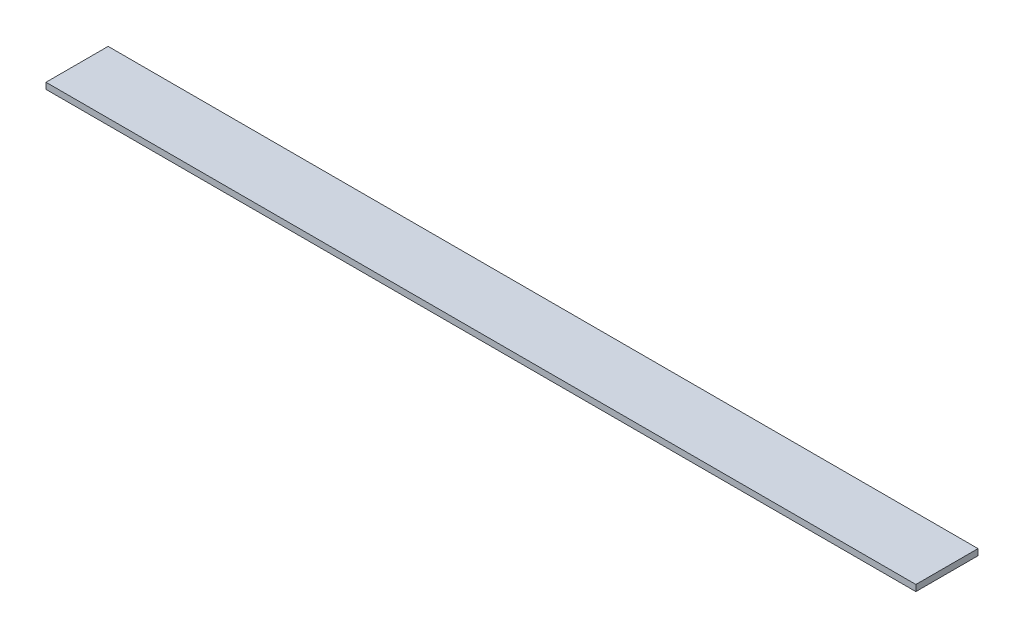
ISO-10303-21;
HEADER;
FILE_DESCRIPTION(('STEP AP214'),'2;1');
FILE_NAME('part.step','',(''),(''),'','','');
FILE_SCHEMA(('AUTOMOTIVE_DESIGN { 1 0 10303 214 1 1 1 1 }'));
ENDSEC;
DATA;
#1=APPLICATION_CONTEXT('core data for automotive mechanical design processes');
#2=APPLICATION_PROTOCOL_DEFINITION('international standard','automotive_design',2000,#1);
#3=PRODUCT_CONTEXT('',#1,'mechanical');
#4=PRODUCT('Part','Part','',(#3));
#5=PRODUCT_RELATED_PRODUCT_CATEGORY('part','',(#4));
#6=PRODUCT_DEFINITION_FORMATION('','',#4);
#7=PRODUCT_DEFINITION_CONTEXT('part definition',#1,'design');
#8=PRODUCT_DEFINITION('design','',#6,#7);
#9=PRODUCT_DEFINITION_SHAPE('','',#8);
#10=(LENGTH_UNIT() NAMED_UNIT(*) SI_UNIT(.MILLI.,.METRE.));
#11=(NAMED_UNIT(*) PLANE_ANGLE_UNIT() SI_UNIT($,.RADIAN.));
#12=(NAMED_UNIT(*) SI_UNIT($,.STERADIAN.) SOLID_ANGLE_UNIT());
#13=UNCERTAINTY_MEASURE_WITH_UNIT(LENGTH_MEASURE(1.E-05),#10,'distance_accuracy_value','');
#14=(GEOMETRIC_REPRESENTATION_CONTEXT(3) GLOBAL_UNCERTAINTY_ASSIGNED_CONTEXT((#13)) GLOBAL_UNIT_ASSIGNED_CONTEXT((#10,
#11,#12)) REPRESENTATION_CONTEXT('',''));
#15=CARTESIAN_POINT('',(0.,0.,0.));
#16=DIRECTION('',(0.,0.,1.));
#17=DIRECTION('',(1.,0.,0.));
#18=AXIS2_PLACEMENT_3D('',#15,#16,#17);
#19=CARTESIAN_POINT('',(0.,10.,0.));
#20=DIRECTION('',(1.,0.,0.));
#21=DIRECTION('',(0.,0.,-1.));
#22=AXIS2_PLACEMENT_3D('',#19,#20,#21);
#23=PLANE('',#22);
#24=DIRECTION('',(0.,0.,1.));
#25=VECTOR('',#24,1.);
#26=CARTESIAN_POINT('',(0.,0.,0.));
#27=LINE('',#26,#25);
#28=CARTESIAN_POINT('',(0.,0.,-100.));
#29=VERTEX_POINT('',#28);
#30=CARTESIAN_POINT('',(0.,0.,0.));
#31=VERTEX_POINT('',#30);
#32=EDGE_CURVE('E94',#29,#31,#27,.T.);
#33=ORIENTED_EDGE('',*,*,#32,.T.);
#34=DIRECTION('',(0.,-1.,0.));
#35=VECTOR('',#34,1.);
#36=CARTESIAN_POINT('',(0.,10.,0.));
#37=LINE('',#36,#35);
#38=CARTESIAN_POINT('',(0.,10.,0.));
#39=VERTEX_POINT('',#38);
#40=EDGE_CURVE('E11',#39,#31,#37,.T.);
#41=ORIENTED_EDGE('',*,*,#40,.F.);
#42=DIRECTION('',(0.,0.,1.));
#43=VECTOR('',#42,1.);
#44=CARTESIAN_POINT('',(0.,10.,0.));
#45=LINE('',#44,#43);
#46=CARTESIAN_POINT('',(0.,10.,-100.));
#47=VERTEX_POINT('',#46);
#48=EDGE_CURVE('E82',#47,#39,#45,.T.);
#49=ORIENTED_EDGE('',*,*,#48,.F.);
#50=DIRECTION('',(0.,-1.,0.));
#51=VECTOR('',#50,1.);
#52=CARTESIAN_POINT('',(0.,10.,-100.));
#53=LINE('',#52,#51);
#54=EDGE_CURVE('E90',#47,#29,#53,.T.);
#55=ORIENTED_EDGE('',*,*,#54,.T.);
#56=EDGE_LOOP('',(#33,#41,#49,#55));
#57=FACE_BOUND('',#56,.T.);
#58=ADVANCED_FACE('F31',(#57),#23,.F.);
#59=CARTESIAN_POINT('',(0.,10.,0.));
#60=DIRECTION('',(0.,0.,-1.));
#61=DIRECTION('',(-1.,0.,0.));
#62=AXIS2_PLACEMENT_3D('',#59,#60,#61);
#63=PLANE('',#62);
#64=DIRECTION('',(1.,0.,0.));
#65=VECTOR('',#64,1.);
#66=CARTESIAN_POINT('',(0.,0.,0.));
#67=LINE('',#66,#65);
#68=CARTESIAN_POINT('',(1400.,0.,0.));
#69=VERTEX_POINT('',#68);
#70=EDGE_CURVE('E86',#31,#69,#67,.T.);
#71=ORIENTED_EDGE('',*,*,#70,.T.);
#72=DIRECTION('',(0.,-1.,0.));
#73=VECTOR('',#72,1.);
#74=CARTESIAN_POINT('',(1400.,10.,0.));
#75=LINE('',#74,#73);
#76=CARTESIAN_POINT('',(1400.,10.,0.));
#77=VERTEX_POINT('',#76);
#78=EDGE_CURVE('E39',#77,#69,#75,.T.);
#79=ORIENTED_EDGE('',*,*,#78,.F.);
#80=DIRECTION('',(1.,0.,0.));
#81=VECTOR('',#80,1.);
#82=CARTESIAN_POINT('',(0.,10.,0.));
#83=LINE('',#82,#81);
#84=EDGE_CURVE('E77',#39,#77,#83,.T.);
#85=ORIENTED_EDGE('',*,*,#84,.F.);
#86=ORIENTED_EDGE('',*,*,#40,.T.);
#87=EDGE_LOOP('',(#71,#79,#85,#86));
#88=FACE_BOUND('',#87,.T.);
#89=ADVANCED_FACE('F85',(#88),#63,.F.);
#90=CARTESIAN_POINT('',(1400.,10.,0.));
#91=DIRECTION('',(-1.,0.,0.));
#92=DIRECTION('',(0.,0.,1.));
#93=AXIS2_PLACEMENT_3D('',#90,#91,#92);
#94=PLANE('',#93);
#95=DIRECTION('',(0.,0.,-1.));
#96=VECTOR('',#95,1.);
#97=CARTESIAN_POINT('',(1400.,0.,0.));
#98=LINE('',#97,#96);
#99=CARTESIAN_POINT('',(1400.,0.,-100.));
#100=VERTEX_POINT('',#99);
#101=EDGE_CURVE('E64',#69,#100,#98,.T.);
#102=ORIENTED_EDGE('',*,*,#101,.T.);
#103=DIRECTION('',(0.,-1.,0.));
#104=VECTOR('',#103,1.);
#105=CARTESIAN_POINT('',(1400.,10.,-100.));
#106=LINE('',#105,#104);
#107=CARTESIAN_POINT('',(1400.,10.,-100.));
#108=VERTEX_POINT('',#107);
#109=EDGE_CURVE('E87',#108,#100,#106,.T.);
#110=ORIENTED_EDGE('',*,*,#109,.F.);
#111=DIRECTION('',(0.,0.,-1.));
#112=VECTOR('',#111,1.);
#113=CARTESIAN_POINT('',(1400.,10.,0.));
#114=LINE('',#113,#112);
#115=EDGE_CURVE('E80',#77,#108,#114,.T.);
#116=ORIENTED_EDGE('',*,*,#115,.F.);
#117=ORIENTED_EDGE('',*,*,#78,.T.);
#118=EDGE_LOOP('',(#102,#110,#116,#117));
#119=FACE_BOUND('',#118,.T.);
#120=ADVANCED_FACE('F88',(#119),#94,.F.);
#121=CARTESIAN_POINT('',(0.,10.,-100.));
#122=DIRECTION('',(0.,0.,1.));
#123=DIRECTION('',(1.,0.,0.));
#124=AXIS2_PLACEMENT_3D('',#121,#122,#123);
#125=PLANE('',#124);
#126=DIRECTION('',(-1.,0.,0.));
#127=VECTOR('',#126,1.);
#128=CARTESIAN_POINT('',(0.,0.,-100.));
#129=LINE('',#128,#127);
#130=EDGE_CURVE('E70',#100,#29,#129,.T.);
#131=ORIENTED_EDGE('',*,*,#130,.T.);
#132=ORIENTED_EDGE('',*,*,#54,.F.);
#133=DIRECTION('',(-1.,0.,0.));
#134=VECTOR('',#133,1.);
#135=CARTESIAN_POINT('',(0.,10.,-100.));
#136=LINE('',#135,#134);
#137=EDGE_CURVE('E47',#108,#47,#136,.T.);
#138=ORIENTED_EDGE('',*,*,#137,.F.);
#139=ORIENTED_EDGE('',*,*,#109,.T.);
#140=EDGE_LOOP('',(#131,#132,#138,#139));
#141=FACE_BOUND('',#140,.T.);
#142=ADVANCED_FACE('F101',(#141),#125,.F.);
#143=CARTESIAN_POINT('',(0.,10.,-100.));
#144=DIRECTION('',(0.,-1.,0.));
#145=DIRECTION('',(0.,0.,-1.));
#146=AXIS2_PLACEMENT_3D('',#143,#144,#145);
#147=PLANE('',#146);
#148=ORIENTED_EDGE('',*,*,#48,.T.);
#149=ORIENTED_EDGE('',*,*,#84,.T.);
#150=ORIENTED_EDGE('',*,*,#115,.T.);
#151=ORIENTED_EDGE('',*,*,#137,.T.);
#152=EDGE_LOOP('',(#148,#149,#150,#151));
#153=FACE_BOUND('',#152,.T.);
#154=ADVANCED_FACE('F78',(#153),#147,.F.);
#155=CARTESIAN_POINT('',(0.,0.,-100.));
#156=DIRECTION('',(0.,-1.,0.));
#157=DIRECTION('',(0.,0.,-1.));
#158=AXIS2_PLACEMENT_3D('',#155,#156,#157);
#159=PLANE('',#158);
#160=ORIENTED_EDGE('',*,*,#32,.F.);
#161=ORIENTED_EDGE('',*,*,#130,.F.);
#162=ORIENTED_EDGE('',*,*,#101,.F.);
#163=ORIENTED_EDGE('',*,*,#70,.F.);
#164=EDGE_LOOP('',(#160,#161,#162,#163));
#165=FACE_BOUND('',#164,.T.);
#166=ADVANCED_FACE('F104',(#165),#159,.T.);
#167=CLOSED_SHELL('',(#58,#89,#120,#142,#154,#166));
#168=MANIFOLD_SOLID_BREP('B2',#167);
#169=ADVANCED_BREP_SHAPE_REPRESENTATION('',(#18,#168),#14);
#170=SHAPE_DEFINITION_REPRESENTATION(#9,#169);
ENDSEC;
END-ISO-10303-21;
